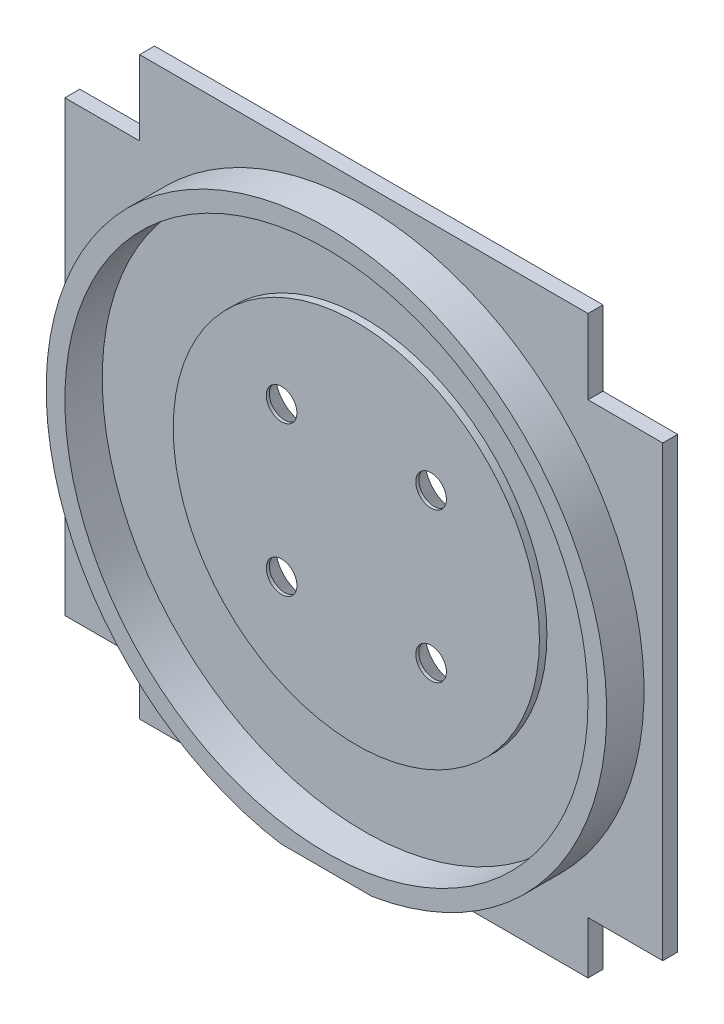
ISO-10303-21;
HEADER;
FILE_DESCRIPTION(('STEP AP214'),'2;1');
FILE_NAME('part.step','',(''),(''),'','','');
FILE_SCHEMA(('AUTOMOTIVE_DESIGN { 1 0 10303 214 1 1 1 1 }'));
ENDSEC;
DATA;
#1=APPLICATION_CONTEXT('core data for automotive mechanical design processes');
#2=APPLICATION_PROTOCOL_DEFINITION('international standard','automotive_design',2000,#1);
#3=PRODUCT_CONTEXT('',#1,'mechanical');
#4=PRODUCT('Part','Part','',(#3));
#5=PRODUCT_RELATED_PRODUCT_CATEGORY('part','',(#4));
#6=PRODUCT_DEFINITION_FORMATION('','',#4);
#7=PRODUCT_DEFINITION_CONTEXT('part definition',#1,'design');
#8=PRODUCT_DEFINITION('design','',#6,#7);
#9=PRODUCT_DEFINITION_SHAPE('','',#8);
#10=(LENGTH_UNIT() NAMED_UNIT(*) SI_UNIT(.MILLI.,.METRE.));
#11=(NAMED_UNIT(*) PLANE_ANGLE_UNIT() SI_UNIT($,.RADIAN.));
#12=(NAMED_UNIT(*) SI_UNIT($,.STERADIAN.) SOLID_ANGLE_UNIT());
#13=UNCERTAINTY_MEASURE_WITH_UNIT(LENGTH_MEASURE(1.E-05),#10,'distance_accuracy_value','');
#14=(GEOMETRIC_REPRESENTATION_CONTEXT(3) GLOBAL_UNCERTAINTY_ASSIGNED_CONTEXT((#13)) GLOBAL_UNIT_ASSIGNED_CONTEXT((#10,
#11,#12)) REPRESENTATION_CONTEXT('',''));
#15=CARTESIAN_POINT('',(0.,0.,0.));
#16=DIRECTION('',(0.,0.,1.));
#17=DIRECTION('',(1.,0.,0.));
#18=AXIS2_PLACEMENT_3D('',#15,#16,#17);
#19=CARTESIAN_POINT('',(0.,0.,2.));
#20=DIRECTION('',(0.,0.,-1.));
#21=DIRECTION('',(-1.,0.,0.));
#22=AXIS2_PLACEMENT_3D('',#19,#20,#21);
#23=PLANE('',#22);
#24=DIRECTION('',(0.,1.,0.));
#25=VECTOR('',#24,1.);
#26=CARTESIAN_POINT('',(70.,0.,2.));
#27=LINE('',#26,#25);
#28=CARTESIAN_POINT('',(70.,3.,2.));
#29=VERTEX_POINT('',#28);
#30=CARTESIAN_POINT('',(70.,10.,2.));
#31=VERTEX_POINT('',#30);
#32=EDGE_CURVE('E48',#29,#31,#27,.T.);
#33=ORIENTED_EDGE('',*,*,#32,.T.);
#34=DIRECTION('',(1.,0.,0.));
#35=VECTOR('',#34,1.);
#36=CARTESIAN_POINT('',(0.,10.,2.));
#37=LINE('',#36,#35);
#38=CARTESIAN_POINT('',(80.,10.,2.));
#39=VERTEX_POINT('',#38);
#40=EDGE_CURVE('E376',#31,#39,#37,.T.);
#41=ORIENTED_EDGE('',*,*,#40,.T.);
#42=DIRECTION('',(0.,1.,0.));
#43=VECTOR('',#42,1.);
#44=CARTESIAN_POINT('',(80.,0.,2.));
#45=LINE('',#44,#43);
#46=CARTESIAN_POINT('',(80.,70.,2.));
#47=VERTEX_POINT('',#46);
#48=EDGE_CURVE('E189',#39,#47,#45,.T.);
#49=ORIENTED_EDGE('',*,*,#48,.T.);
#50=DIRECTION('',(-1.,0.,0.));
#51=VECTOR('',#50,1.);
#52=CARTESIAN_POINT('',(0.,70.,2.));
#53=LINE('',#52,#51);
#54=CARTESIAN_POINT('',(70.,70.,2.));
#55=VERTEX_POINT('',#54);
#56=EDGE_CURVE('E156',#47,#55,#53,.T.);
#57=ORIENTED_EDGE('',*,*,#56,.T.);
#58=DIRECTION('',(0.,1.,0.));
#59=VECTOR('',#58,1.);
#60=CARTESIAN_POINT('',(70.,0.,2.));
#61=LINE('',#60,#59);
#62=CARTESIAN_POINT('',(70.,80.,2.));
#63=VERTEX_POINT('',#62);
#64=EDGE_CURVE('E150',#55,#63,#61,.T.);
#65=ORIENTED_EDGE('',*,*,#64,.T.);
#66=DIRECTION('',(-1.,0.,0.));
#67=VECTOR('',#66,1.);
#68=CARTESIAN_POINT('',(0.,80.,2.));
#69=LINE('',#68,#67);
#70=CARTESIAN_POINT('',(10.,80.,2.));
#71=VERTEX_POINT('',#70);
#72=EDGE_CURVE('E192',#63,#71,#69,.T.);
#73=ORIENTED_EDGE('',*,*,#72,.T.);
#74=DIRECTION('',(0.,-1.,0.));
#75=VECTOR('',#74,1.);
#76=CARTESIAN_POINT('',(9.99999999999999,0.,2.));
#77=LINE('',#76,#75);
#78=CARTESIAN_POINT('',(10.,70.,2.));
#79=VERTEX_POINT('',#78);
#80=EDGE_CURVE('E404',#71,#79,#77,.T.);
#81=ORIENTED_EDGE('',*,*,#80,.T.);
#82=DIRECTION('',(-1.,0.,0.));
#83=VECTOR('',#82,1.);
#84=CARTESIAN_POINT('',(0.,70.,2.));
#85=LINE('',#84,#83);
#86=CARTESIAN_POINT('',(0.,70.,2.));
#87=VERTEX_POINT('',#86);
#88=EDGE_CURVE('E410',#79,#87,#85,.T.);
#89=ORIENTED_EDGE('',*,*,#88,.T.);
#90=DIRECTION('',(0.,-1.,0.));
#91=VECTOR('',#90,1.);
#92=CARTESIAN_POINT('',(0.,0.,2.));
#93=LINE('',#92,#91);
#94=CARTESIAN_POINT('',(0.,10.,2.));
#95=VERTEX_POINT('',#94);
#96=EDGE_CURVE('E186',#87,#95,#93,.T.);
#97=ORIENTED_EDGE('',*,*,#96,.T.);
#98=DIRECTION('',(1.,0.,0.));
#99=VECTOR('',#98,1.);
#100=CARTESIAN_POINT('',(0.,10.,2.));
#101=LINE('',#100,#99);
#102=CARTESIAN_POINT('',(10.,10.,2.));
#103=VERTEX_POINT('',#102);
#104=EDGE_CURVE('E393',#95,#103,#101,.T.);
#105=ORIENTED_EDGE('',*,*,#104,.T.);
#106=DIRECTION('',(0.,-1.,0.));
#107=VECTOR('',#106,1.);
#108=CARTESIAN_POINT('',(10.,0.,2.));
#109=LINE('',#108,#107);
#110=CARTESIAN_POINT('',(10.,3.,2.));
#111=VERTEX_POINT('',#110);
#112=EDGE_CURVE('E244',#103,#111,#109,.T.);
#113=ORIENTED_EDGE('',*,*,#112,.T.);
#114=DIRECTION('',(1.,0.,0.));
#115=VECTOR('',#114,1.);
#116=CARTESIAN_POINT('',(0.,3.,2.));
#117=LINE('',#116,#115);
#118=CARTESIAN_POINT('',(33.8967221921331,3.,2.));
#119=VERTEX_POINT('',#118);
#120=EDGE_CURVE('E153',#111,#119,#117,.T.);
#121=ORIENTED_EDGE('',*,*,#120,.T.);
#122=CARTESIAN_POINT('',(40.,40.,2.));
#123=DIRECTION('',(0.,0.,-1.));
#124=DIRECTION('',(-1.,0.,0.));
#125=AXIS2_PLACEMENT_3D('',#122,#123,#124);
#126=CIRCLE('',#125,37.5);
#127=CARTESIAN_POINT('',(46.1032778078669,3.,2.));
#128=VERTEX_POINT('',#127);
#129=EDGE_CURVE('E228',#128,#119,#126,.F.);
#130=ORIENTED_EDGE('',*,*,#129,.F.);
#131=EDGE_CURVE('E160',#128,#29,#117,.T.);
#132=ORIENTED_EDGE('',*,*,#131,.T.);
#133=EDGE_LOOP('',(#33,#41,#49,#57,#65,#73,#81,#89,#97,#105,#113,#121,#130,#132));
#134=FACE_BOUND('',#133,.T.);
#135=ADVANCED_FACE('F33',(#134),#23,.F.);
#136=CARTESIAN_POINT('',(40.,40.,2.));
#137=DIRECTION('',(0.,0.,1.));
#138=DIRECTION('',(1.,0.,0.));
#139=AXIS2_PLACEMENT_3D('',#136,#137,#138);
#140=CIRCLE('',#139,35.);
#141=CARTESIAN_POINT('',(75.,40.,2.));
#142=VERTEX_POINT('',#141);
#143=EDGE_CURVE('E165',#142,#142,#140,.T.);
#144=ORIENTED_EDGE('',*,*,#143,.T.);
#145=EDGE_LOOP('',(#144));
#146=FACE_BOUND('',#145,.T.);
#147=CARTESIAN_POINT('',(40.,40.,2.));
#148=DIRECTION('',(0.,0.,-1.));
#149=DIRECTION('',(-1.,0.,0.));
#150=AXIS2_PLACEMENT_3D('',#147,#148,#149);
#151=CIRCLE('',#150,24.5);
#152=CARTESIAN_POINT('',(15.5,40.,2.));
#153=VERTEX_POINT('',#152);
#154=EDGE_CURVE('E195',#153,#153,#151,.F.);
#155=ORIENTED_EDGE('',*,*,#154,.F.);
#156=EDGE_LOOP('',(#155));
#157=FACE_BOUND('',#156,.T.);
#158=ADVANCED_FACE('F258',(#146,#157),#23,.F.);
#159=CARTESIAN_POINT('',(0.,0.,2.));
#160=DIRECTION('',(1.,0.,0.));
#161=DIRECTION('',(0.,0.,-1.));
#162=AXIS2_PLACEMENT_3D('',#159,#160,#161);
#163=PLANE('',#162);
#164=DIRECTION('',(0.,-1.,0.));
#165=VECTOR('',#164,1.);
#166=CARTESIAN_POINT('',(0.,0.,0.));
#167=LINE('',#166,#165);
#168=CARTESIAN_POINT('',(0.,70.,0.));
#169=VERTEX_POINT('',#168);
#170=CARTESIAN_POINT('',(0.,10.,0.));
#171=VERTEX_POINT('',#170);
#172=EDGE_CURVE('E185',#169,#171,#167,.T.);
#173=ORIENTED_EDGE('',*,*,#172,.T.);
#174=DIRECTION('',(0.,0.,-1.));
#175=VECTOR('',#174,1.);
#176=CARTESIAN_POINT('',(0.,10.,7.));
#177=LINE('',#176,#175);
#178=EDGE_CURVE('E388',#95,#171,#177,.T.);
#179=ORIENTED_EDGE('',*,*,#178,.F.);
#180=ORIENTED_EDGE('',*,*,#96,.F.);
#181=DIRECTION('',(0.,0.,-1.));
#182=VECTOR('',#181,1.);
#183=CARTESIAN_POINT('',(0.,70.,7.));
#184=LINE('',#183,#182);
#185=EDGE_CURVE('E401',#87,#169,#184,.T.);
#186=ORIENTED_EDGE('',*,*,#185,.T.);
#187=EDGE_LOOP('',(#173,#179,#180,#186));
#188=FACE_BOUND('',#187,.T.);
#189=ADVANCED_FACE('F261',(#188),#163,.F.);
#190=CARTESIAN_POINT('',(80.,0.,2.));
#191=DIRECTION('',(-1.,0.,0.));
#192=DIRECTION('',(0.,0.,1.));
#193=AXIS2_PLACEMENT_3D('',#190,#191,#192);
#194=PLANE('',#193);
#195=ORIENTED_EDGE('',*,*,#48,.F.);
#196=DIRECTION('',(0.,0.,-1.));
#197=VECTOR('',#196,1.);
#198=CARTESIAN_POINT('',(80.,10.,7.));
#199=LINE('',#198,#197);
#200=CARTESIAN_POINT('',(80.,10.,0.));
#201=VERTEX_POINT('',#200);
#202=EDGE_CURVE('E377',#39,#201,#199,.T.);
#203=ORIENTED_EDGE('',*,*,#202,.T.);
#204=DIRECTION('',(0.,1.,0.));
#205=VECTOR('',#204,1.);
#206=CARTESIAN_POINT('',(80.,0.,0.));
#207=LINE('',#206,#205);
#208=CARTESIAN_POINT('',(80.,70.,0.));
#209=VERTEX_POINT('',#208);
#210=EDGE_CURVE('E198',#201,#209,#207,.T.);
#211=ORIENTED_EDGE('',*,*,#210,.T.);
#212=DIRECTION('',(0.,0.,-1.));
#213=VECTOR('',#212,1.);
#214=CARTESIAN_POINT('',(80.,70.,7.));
#215=LINE('',#214,#213);
#216=EDGE_CURVE('E418',#47,#209,#215,.T.);
#217=ORIENTED_EDGE('',*,*,#216,.F.);
#218=EDGE_LOOP('',(#195,#203,#211,#217));
#219=FACE_BOUND('',#218,.T.);
#220=ADVANCED_FACE('F286',(#219),#194,.F.);
#221=CARTESIAN_POINT('',(0.,80.,2.));
#222=DIRECTION('',(0.,-1.,0.));
#223=DIRECTION('',(0.,0.,-1.));
#224=AXIS2_PLACEMENT_3D('',#221,#222,#223);
#225=PLANE('',#224);
#226=DIRECTION('',(-1.,0.,0.));
#227=VECTOR('',#226,1.);
#228=CARTESIAN_POINT('',(0.,80.,0.));
#229=LINE('',#228,#227);
#230=CARTESIAN_POINT('',(70.,80.,0.));
#231=VERTEX_POINT('',#230);
#232=CARTESIAN_POINT('',(10.,80.,0.));
#233=VERTEX_POINT('',#232);
#234=EDGE_CURVE('E190',#231,#233,#229,.T.);
#235=ORIENTED_EDGE('',*,*,#234,.T.);
#236=DIRECTION('',(0.,0.,-1.));
#237=VECTOR('',#236,1.);
#238=CARTESIAN_POINT('',(10.,80.,7.));
#239=LINE('',#238,#237);
#240=EDGE_CURVE('E400',#71,#233,#239,.T.);
#241=ORIENTED_EDGE('',*,*,#240,.F.);
#242=ORIENTED_EDGE('',*,*,#72,.F.);
#243=DIRECTION('',(0.,0.,-1.));
#244=VECTOR('',#243,1.);
#245=CARTESIAN_POINT('',(70.,80.,7.));
#246=LINE('',#245,#244);
#247=EDGE_CURVE('E419',#63,#231,#246,.T.);
#248=ORIENTED_EDGE('',*,*,#247,.T.);
#249=EDGE_LOOP('',(#235,#241,#242,#248));
#250=FACE_BOUND('',#249,.T.);
#251=ADVANCED_FACE('F277',(#250),#225,.F.);
#252=CARTESIAN_POINT('',(0.,0.,0.));
#253=DIRECTION('',(0.,0.,-1.));
#254=DIRECTION('',(-1.,0.,0.));
#255=AXIS2_PLACEMENT_3D('',#252,#253,#254);
#256=PLANE('',#255);
#257=DIRECTION('',(1.,0.,0.));
#258=VECTOR('',#257,1.);
#259=CARTESIAN_POINT('',(80.,10.,0.));
#260=LINE('',#259,#258);
#261=CARTESIAN_POINT('',(70.,10.,0.));
#262=VERTEX_POINT('',#261);
#263=EDGE_CURVE('E145',#262,#201,#260,.T.);
#264=ORIENTED_EDGE('',*,*,#263,.F.);
#265=DIRECTION('',(0.,1.,0.));
#266=VECTOR('',#265,1.);
#267=CARTESIAN_POINT('',(70.,3.,0.));
#268=LINE('',#267,#266);
#269=CARTESIAN_POINT('',(70.,3.,0.));
#270=VERTEX_POINT('',#269);
#271=EDGE_CURVE('E134',#270,#262,#268,.T.);
#272=ORIENTED_EDGE('',*,*,#271,.F.);
#273=DIRECTION('',(1.,0.,0.));
#274=VECTOR('',#273,1.);
#275=CARTESIAN_POINT('',(80.,3.,0.));
#276=LINE('',#275,#274);
#277=CARTESIAN_POINT('',(9.99999999999999,3.,0.));
#278=VERTEX_POINT('',#277);
#279=EDGE_CURVE('E143',#278,#270,#276,.T.);
#280=ORIENTED_EDGE('',*,*,#279,.F.);
#281=DIRECTION('',(0.,-1.,0.));
#282=VECTOR('',#281,1.);
#283=CARTESIAN_POINT('',(10.,3.,0.));
#284=LINE('',#283,#282);
#285=CARTESIAN_POINT('',(10.,10.,0.));
#286=VERTEX_POINT('',#285);
#287=EDGE_CURVE('E55',#286,#278,#284,.T.);
#288=ORIENTED_EDGE('',*,*,#287,.F.);
#289=DIRECTION('',(1.,0.,0.));
#290=VECTOR('',#289,1.);
#291=CARTESIAN_POINT('',(0.,10.,0.));
#292=LINE('',#291,#290);
#293=EDGE_CURVE('E384',#171,#286,#292,.T.);
#294=ORIENTED_EDGE('',*,*,#293,.F.);
#295=ORIENTED_EDGE('',*,*,#172,.F.);
#296=DIRECTION('',(-1.,0.,0.));
#297=VECTOR('',#296,1.);
#298=CARTESIAN_POINT('',(0.,70.,0.));
#299=LINE('',#298,#297);
#300=CARTESIAN_POINT('',(10.,70.,0.));
#301=VERTEX_POINT('',#300);
#302=EDGE_CURVE('E398',#301,#169,#299,.T.);
#303=ORIENTED_EDGE('',*,*,#302,.F.);
#304=DIRECTION('',(0.,-1.,0.));
#305=VECTOR('',#304,1.);
#306=CARTESIAN_POINT('',(10.,80.,0.));
#307=LINE('',#306,#305);
#308=EDGE_CURVE('E395',#233,#301,#307,.T.);
#309=ORIENTED_EDGE('',*,*,#308,.F.);
#310=ORIENTED_EDGE('',*,*,#234,.F.);
#311=DIRECTION('',(0.,1.,0.));
#312=VECTOR('',#311,1.);
#313=CARTESIAN_POINT('',(70.,80.,0.));
#314=LINE('',#313,#312);
#315=CARTESIAN_POINT('',(70.,70.,0.));
#316=VERTEX_POINT('',#315);
#317=EDGE_CURVE('E416',#316,#231,#314,.T.);
#318=ORIENTED_EDGE('',*,*,#317,.F.);
#319=DIRECTION('',(-1.,0.,0.));
#320=VECTOR('',#319,1.);
#321=CARTESIAN_POINT('',(80.,70.,0.));
#322=LINE('',#321,#320);
#323=EDGE_CURVE('E413',#209,#316,#322,.T.);
#324=ORIENTED_EDGE('',*,*,#323,.F.);
#325=ORIENTED_EDGE('',*,*,#210,.F.);
#326=EDGE_LOOP('',(#264,#272,#280,#288,#294,#295,#303,#309,#310,#318,#324,#325));
#327=FACE_BOUND('',#326,.T.);
#328=CARTESIAN_POINT('',(50.,30.,0.));
#329=DIRECTION('',(0.,0.,-1.));
#330=DIRECTION('',(-1.,0.,0.));
#331=AXIS2_PLACEMENT_3D('',#328,#329,#330);
#332=CIRCLE('',#331,3.8);
#333=CARTESIAN_POINT('',(46.2,30.,0.));
#334=VERTEX_POINT('',#333);
#335=EDGE_CURVE('E216',#334,#334,#332,.F.);
#336=ORIENTED_EDGE('',*,*,#335,.T.);
#337=EDGE_LOOP('',(#336));
#338=FACE_BOUND('',#337,.T.);
#339=CARTESIAN_POINT('',(30.,30.,0.));
#340=DIRECTION('',(0.,0.,-1.));
#341=DIRECTION('',(-1.,0.,0.));
#342=AXIS2_PLACEMENT_3D('',#339,#340,#341);
#343=CIRCLE('',#342,3.80000000000001);
#344=CARTESIAN_POINT('',(26.2,30.,0.));
#345=VERTEX_POINT('',#344);
#346=EDGE_CURVE('E213',#345,#345,#343,.F.);
#347=ORIENTED_EDGE('',*,*,#346,.T.);
#348=EDGE_LOOP('',(#347));
#349=FACE_BOUND('',#348,.T.);
#350=CARTESIAN_POINT('',(30.,50.,0.));
#351=DIRECTION('',(0.,0.,-1.));
#352=DIRECTION('',(-1.,0.,0.));
#353=AXIS2_PLACEMENT_3D('',#350,#351,#352);
#354=CIRCLE('',#353,3.80000000000001);
#355=CARTESIAN_POINT('',(26.2,50.,0.));
#356=VERTEX_POINT('',#355);
#357=EDGE_CURVE('E210',#356,#356,#354,.F.);
#358=ORIENTED_EDGE('',*,*,#357,.T.);
#359=EDGE_LOOP('',(#358));
#360=FACE_BOUND('',#359,.T.);
#361=CARTESIAN_POINT('',(50.,50.,0.));
#362=DIRECTION('',(0.,0.,-1.));
#363=DIRECTION('',(-1.,0.,0.));
#364=AXIS2_PLACEMENT_3D('',#361,#362,#363);
#365=CIRCLE('',#364,3.8);
#366=CARTESIAN_POINT('',(46.2,50.,0.));
#367=VERTEX_POINT('',#366);
#368=EDGE_CURVE('E207',#367,#367,#365,.F.);
#369=ORIENTED_EDGE('',*,*,#368,.T.);
#370=EDGE_LOOP('',(#369));
#371=FACE_BOUND('',#370,.T.);
#372=ADVANCED_FACE('F141',(#327,#338,#349,#360,#371),#256,.T.);
#373=CARTESIAN_POINT('',(40.,40.,3.));
#374=DIRECTION('',(0.,0.,-1.));
#375=DIRECTION('',(-1.,0.,0.));
#376=AXIS2_PLACEMENT_3D('',#373,#374,#375);
#377=CYLINDRICAL_SURFACE('',#376,24.5);
#378=CARTESIAN_POINT('',(40.,40.,3.));
#379=DIRECTION('',(0.,0.,1.));
#380=DIRECTION('',(1.,0.,0.));
#381=AXIS2_PLACEMENT_3D('',#378,#379,#380);
#382=CIRCLE('',#381,24.5);
#383=CARTESIAN_POINT('',(64.5,40.,3.));
#384=VERTEX_POINT('',#383);
#385=EDGE_CURVE('E182',#384,#384,#382,.T.);
#386=ORIENTED_EDGE('',*,*,#385,.F.);
#387=EDGE_LOOP('',(#386));
#388=FACE_BOUND('',#387,.T.);
#389=ORIENTED_EDGE('',*,*,#154,.T.);
#390=EDGE_LOOP('',(#389));
#391=FACE_BOUND('',#390,.T.);
#392=ADVANCED_FACE('F265',(#388,#391),#377,.T.);
#393=CARTESIAN_POINT('',(40.,40.,3.));
#394=DIRECTION('',(0.,0.,1.));
#395=DIRECTION('',(1.,0.,0.));
#396=AXIS2_PLACEMENT_3D('',#393,#394,#395);
#397=PLANE('',#396);
#398=CARTESIAN_POINT('',(30.,50.,3.));
#399=DIRECTION('',(0.,0.,-1.));
#400=DIRECTION('',(-1.,0.,0.));
#401=AXIS2_PLACEMENT_3D('',#398,#399,#400);
#402=CIRCLE('',#401,2.05);
#403=CARTESIAN_POINT('',(27.95,50.,3.));
#404=VERTEX_POINT('',#403);
#405=EDGE_CURVE('E170',#404,#404,#402,.T.);
#406=ORIENTED_EDGE('',*,*,#405,.T.);
#407=EDGE_LOOP('',(#406));
#408=FACE_BOUND('',#407,.T.);
#409=CARTESIAN_POINT('',(30.,30.,3.));
#410=DIRECTION('',(0.,0.,-1.));
#411=DIRECTION('',(-1.,0.,0.));
#412=AXIS2_PLACEMENT_3D('',#409,#410,#411);
#413=CIRCLE('',#412,2.05);
#414=CARTESIAN_POINT('',(27.95,30.,3.));
#415=VERTEX_POINT('',#414);
#416=EDGE_CURVE('E173',#415,#415,#413,.T.);
#417=ORIENTED_EDGE('',*,*,#416,.T.);
#418=EDGE_LOOP('',(#417));
#419=FACE_BOUND('',#418,.T.);
#420=CARTESIAN_POINT('',(50.,30.,3.));
#421=DIRECTION('',(0.,0.,-1.));
#422=DIRECTION('',(-1.,0.,0.));
#423=AXIS2_PLACEMENT_3D('',#420,#421,#422);
#424=CIRCLE('',#423,2.04999999999999);
#425=CARTESIAN_POINT('',(47.95,30.,3.));
#426=VERTEX_POINT('',#425);
#427=EDGE_CURVE('E176',#426,#426,#424,.T.);
#428=ORIENTED_EDGE('',*,*,#427,.T.);
#429=EDGE_LOOP('',(#428));
#430=FACE_BOUND('',#429,.T.);
#431=CARTESIAN_POINT('',(50.,50.,3.));
#432=DIRECTION('',(0.,0.,-1.));
#433=DIRECTION('',(-1.,0.,0.));
#434=AXIS2_PLACEMENT_3D('',#431,#432,#433);
#435=CIRCLE('',#434,2.04999999999999);
#436=CARTESIAN_POINT('',(47.95,50.,3.));
#437=VERTEX_POINT('',#436);
#438=EDGE_CURVE('E179',#437,#437,#435,.T.);
#439=ORIENTED_EDGE('',*,*,#438,.T.);
#440=EDGE_LOOP('',(#439));
#441=FACE_BOUND('',#440,.T.);
#442=ORIENTED_EDGE('',*,*,#385,.T.);
#443=EDGE_LOOP('',(#442));
#444=FACE_BOUND('',#443,.T.);
#445=ADVANCED_FACE('F267',(#408,#419,#430,#441,#444),#397,.T.);
#446=CARTESIAN_POINT('',(50.,50.,3.));
#447=DIRECTION('',(0.,0.,-1.));
#448=DIRECTION('',(-1.,0.,0.));
#449=AXIS2_PLACEMENT_3D('',#446,#447,#448);
#450=CYLINDRICAL_SURFACE('',#449,2.04999999999999);
#451=CARTESIAN_POINT('',(50.,50.,2.59448169489728));
#452=DIRECTION('',(0.,0.,-1.));
#453=DIRECTION('',(-1.,0.,0.));
#454=AXIS2_PLACEMENT_3D('',#451,#452,#453);
#455=CIRCLE('',#454,2.04999999999999);
#456=CARTESIAN_POINT('',(47.95,50.,2.59448169489728));
#457=VERTEX_POINT('',#456);
#458=EDGE_CURVE('E225',#457,#457,#455,.T.);
#459=ORIENTED_EDGE('',*,*,#458,.T.);
#460=EDGE_LOOP('',(#459));
#461=FACE_BOUND('',#460,.T.);
#462=ORIENTED_EDGE('',*,*,#438,.F.);
#463=EDGE_LOOP('',(#462));
#464=FACE_BOUND('',#463,.T.);
#465=ADVANCED_FACE('F274',(#461,#464),#450,.F.);
#466=CARTESIAN_POINT('',(50.,30.,3.));
#467=DIRECTION('',(0.,0.,-1.));
#468=DIRECTION('',(-1.,0.,0.));
#469=AXIS2_PLACEMENT_3D('',#466,#467,#468);
#470=CYLINDRICAL_SURFACE('',#469,2.04999999999999);
#471=CARTESIAN_POINT('',(50.,30.,2.59448169489728));
#472=DIRECTION('',(0.,0.,-1.));
#473=DIRECTION('',(-1.,0.,0.));
#474=AXIS2_PLACEMENT_3D('',#471,#472,#473);
#475=CIRCLE('',#474,2.04999999999999);
#476=CARTESIAN_POINT('',(47.95,30.,2.59448169489728));
#477=VERTEX_POINT('',#476);
#478=EDGE_CURVE('E204',#477,#477,#475,.T.);
#479=ORIENTED_EDGE('',*,*,#478,.T.);
#480=EDGE_LOOP('',(#479));
#481=FACE_BOUND('',#480,.T.);
#482=ORIENTED_EDGE('',*,*,#427,.F.);
#483=EDGE_LOOP('',(#482));
#484=FACE_BOUND('',#483,.T.);
#485=ADVANCED_FACE('F327',(#481,#484),#470,.F.);
#486=CARTESIAN_POINT('',(30.,30.,3.));
#487=DIRECTION('',(0.,0.,-1.));
#488=DIRECTION('',(-1.,0.,0.));
#489=AXIS2_PLACEMENT_3D('',#486,#487,#488);
#490=CYLINDRICAL_SURFACE('',#489,2.05);
#491=CARTESIAN_POINT('',(30.,30.,2.59448169489731));
#492=DIRECTION('',(0.,0.,-1.));
#493=DIRECTION('',(-1.,0.,0.));
#494=AXIS2_PLACEMENT_3D('',#491,#492,#493);
#495=CIRCLE('',#494,2.05);
#496=CARTESIAN_POINT('',(27.95,30.,2.59448169489731));
#497=VERTEX_POINT('',#496);
#498=EDGE_CURVE('E219',#497,#497,#495,.T.);
#499=ORIENTED_EDGE('',*,*,#498,.T.);
#500=EDGE_LOOP('',(#499));
#501=FACE_BOUND('',#500,.T.);
#502=ORIENTED_EDGE('',*,*,#416,.F.);
#503=EDGE_LOOP('',(#502));
#504=FACE_BOUND('',#503,.T.);
#505=ADVANCED_FACE('F315',(#501,#504),#490,.F.);
#506=CARTESIAN_POINT('',(30.,50.,3.));
#507=DIRECTION('',(0.,0.,-1.));
#508=DIRECTION('',(-1.,0.,0.));
#509=AXIS2_PLACEMENT_3D('',#506,#507,#508);
#510=CYLINDRICAL_SURFACE('',#509,2.05);
#511=CARTESIAN_POINT('',(30.,50.,2.59448169489731));
#512=DIRECTION('',(0.,0.,-1.));
#513=DIRECTION('',(-1.,0.,0.));
#514=AXIS2_PLACEMENT_3D('',#511,#512,#513);
#515=CIRCLE('',#514,2.05);
#516=CARTESIAN_POINT('',(27.95,50.,2.59448169489731));
#517=VERTEX_POINT('',#516);
#518=EDGE_CURVE('E222',#517,#517,#515,.T.);
#519=ORIENTED_EDGE('',*,*,#518,.T.);
#520=EDGE_LOOP('',(#519));
#521=FACE_BOUND('',#520,.T.);
#522=ORIENTED_EDGE('',*,*,#405,.F.);
#523=EDGE_LOOP('',(#522));
#524=FACE_BOUND('',#523,.T.);
#525=ADVANCED_FACE('F298',(#521,#524),#510,.F.);
#526=CARTESIAN_POINT('',(50.,30.,2.59448169489728));
#527=DIRECTION('',(0.,0.,-1.));
#528=DIRECTION('',(-1.,0.,0.));
#529=AXIS2_PLACEMENT_3D('',#526,#527,#528);
#530=CONICAL_SURFACE('',#529,2.04999999999999,0.593411945678076);
#531=ORIENTED_EDGE('',*,*,#335,.F.);
#532=EDGE_LOOP('',(#531));
#533=FACE_BOUND('',#532,.T.);
#534=ORIENTED_EDGE('',*,*,#478,.F.);
#535=EDGE_LOOP('',(#534));
#536=FACE_BOUND('',#535,.T.);
#537=ADVANCED_FACE('F294',(#533,#536),#530,.F.);
#538=CARTESIAN_POINT('',(30.,30.,2.59448169489731));
#539=DIRECTION('',(0.,0.,-1.));
#540=DIRECTION('',(-1.,0.,0.));
#541=AXIS2_PLACEMENT_3D('',#538,#539,#540);
#542=CONICAL_SURFACE('',#541,2.05,0.593411945678072);
#543=ORIENTED_EDGE('',*,*,#346,.F.);
#544=EDGE_LOOP('',(#543));
#545=FACE_BOUND('',#544,.T.);
#546=ORIENTED_EDGE('',*,*,#498,.F.);
#547=EDGE_LOOP('',(#546));
#548=FACE_BOUND('',#547,.T.);
#549=ADVANCED_FACE('F297',(#545,#548),#542,.F.);
#550=CARTESIAN_POINT('',(30.,50.,2.59448169489731));
#551=DIRECTION('',(0.,0.,-1.));
#552=DIRECTION('',(-1.,0.,0.));
#553=AXIS2_PLACEMENT_3D('',#550,#551,#552);
#554=CONICAL_SURFACE('',#553,2.05,0.593411945678072);
#555=ORIENTED_EDGE('',*,*,#357,.F.);
#556=EDGE_LOOP('',(#555));
#557=FACE_BOUND('',#556,.T.);
#558=ORIENTED_EDGE('',*,*,#518,.F.);
#559=EDGE_LOOP('',(#558));
#560=FACE_BOUND('',#559,.T.);
#561=ADVANCED_FACE('F301',(#557,#560),#554,.F.);
#562=CARTESIAN_POINT('',(50.,50.,2.59448169489728));
#563=DIRECTION('',(0.,0.,-1.));
#564=DIRECTION('',(-1.,0.,0.));
#565=AXIS2_PLACEMENT_3D('',#562,#563,#564);
#566=CONICAL_SURFACE('',#565,2.04999999999999,0.593411945678076);
#567=ORIENTED_EDGE('',*,*,#368,.F.);
#568=EDGE_LOOP('',(#567));
#569=FACE_BOUND('',#568,.T.);
#570=ORIENTED_EDGE('',*,*,#458,.F.);
#571=EDGE_LOOP('',(#570));
#572=FACE_BOUND('',#571,.T.);
#573=ADVANCED_FACE('F35',(#569,#572),#566,.F.);
#574=CARTESIAN_POINT('',(40.,40.,7.));
#575=DIRECTION('',(0.,0.,1.));
#576=DIRECTION('',(1.,0.,0.));
#577=AXIS2_PLACEMENT_3D('',#574,#575,#576);
#578=PLANE('',#577);
#579=DIRECTION('',(1.,0.,0.));
#580=VECTOR('',#579,1.);
#581=CARTESIAN_POINT('',(80.,3.,7.));
#582=LINE('',#581,#580);
#583=CARTESIAN_POINT('',(33.8967221921331,3.,7.));
#584=VERTEX_POINT('',#583);
#585=CARTESIAN_POINT('',(46.1032778078669,3.,7.));
#586=VERTEX_POINT('',#585);
#587=EDGE_CURVE('E149',#584,#586,#582,.T.);
#588=ORIENTED_EDGE('',*,*,#587,.T.);
#589=CARTESIAN_POINT('',(40.,40.,7.));
#590=DIRECTION('',(0.,0.,1.));
#591=DIRECTION('',(1.,0.,0.));
#592=AXIS2_PLACEMENT_3D('',#589,#590,#591);
#593=CIRCLE('',#592,37.5);
#594=EDGE_CURVE('E164',#586,#584,#593,.T.);
#595=ORIENTED_EDGE('',*,*,#594,.T.);
#596=EDGE_LOOP('',(#588,#595));
#597=FACE_BOUND('',#596,.T.);
#598=CARTESIAN_POINT('',(40.,40.,7.));
#599=DIRECTION('',(0.,0.,1.));
#600=DIRECTION('',(1.,0.,0.));
#601=AXIS2_PLACEMENT_3D('',#598,#599,#600);
#602=CIRCLE('',#601,35.);
#603=CARTESIAN_POINT('',(75.,40.,7.));
#604=VERTEX_POINT('',#603);
#605=EDGE_CURVE('E161',#604,#604,#602,.T.);
#606=ORIENTED_EDGE('',*,*,#605,.F.);
#607=EDGE_LOOP('',(#606));
#608=FACE_BOUND('',#607,.T.);
#609=ADVANCED_FACE('F246',(#597,#608),#578,.T.);
#610=CARTESIAN_POINT('',(40.,40.,7.));
#611=DIRECTION('',(0.,0.,-1.));
#612=DIRECTION('',(-1.,0.,0.));
#613=AXIS2_PLACEMENT_3D('',#610,#611,#612);
#614=CYLINDRICAL_SURFACE('',#613,37.5);
#615=ORIENTED_EDGE('',*,*,#594,.F.);
#616=DIRECTION('',(0.,0.,-1.));
#617=VECTOR('',#616,1.);
#618=CARTESIAN_POINT('',(46.1032778078669,3.,7.));
#619=LINE('',#618,#617);
#620=EDGE_CURVE('E234',#586,#128,#619,.T.);
#621=ORIENTED_EDGE('',*,*,#620,.T.);
#622=ORIENTED_EDGE('',*,*,#129,.T.);
#623=DIRECTION('',(0.,0.,-1.));
#624=VECTOR('',#623,1.);
#625=CARTESIAN_POINT('',(33.8967221921331,3.,7.));
#626=LINE('',#625,#624);
#627=EDGE_CURVE('E231',#119,#584,#626,.F.);
#628=ORIENTED_EDGE('',*,*,#627,.T.);
#629=EDGE_LOOP('',(#615,#621,#622,#628));
#630=FACE_BOUND('',#629,.T.);
#631=ADVANCED_FACE('F239',(#630),#614,.T.);
#632=CARTESIAN_POINT('',(40.,40.,7.));
#633=DIRECTION('',(0.,0.,-1.));
#634=DIRECTION('',(-1.,0.,0.));
#635=AXIS2_PLACEMENT_3D('',#632,#633,#634);
#636=CYLINDRICAL_SURFACE('',#635,35.);
#637=ORIENTED_EDGE('',*,*,#605,.T.);
#638=EDGE_LOOP('',(#637));
#639=FACE_BOUND('',#638,.T.);
#640=ORIENTED_EDGE('',*,*,#143,.F.);
#641=EDGE_LOOP('',(#640));
#642=FACE_BOUND('',#641,.T.);
#643=ADVANCED_FACE('F252',(#639,#642),#636,.F.);
#644=CARTESIAN_POINT('',(80.,3.,7.));
#645=DIRECTION('',(0.,1.,0.));
#646=DIRECTION('',(-1.,0.,0.));
#647=AXIS2_PLACEMENT_3D('',#644,#645,#646);
#648=PLANE('',#647);
#649=ORIENTED_EDGE('',*,*,#279,.T.);
#650=DIRECTION('',(0.,0.,1.));
#651=VECTOR('',#650,1.);
#652=CARTESIAN_POINT('',(70.,3.,7.));
#653=LINE('',#652,#651);
#654=EDGE_CURVE('E11',#270,#29,#653,.T.);
#655=ORIENTED_EDGE('',*,*,#654,.T.);
#656=ORIENTED_EDGE('',*,*,#131,.F.);
#657=ORIENTED_EDGE('',*,*,#620,.F.);
#658=ORIENTED_EDGE('',*,*,#587,.F.);
#659=ORIENTED_EDGE('',*,*,#627,.F.);
#660=ORIENTED_EDGE('',*,*,#120,.F.);
#661=DIRECTION('',(0.,0.,-1.));
#662=VECTOR('',#661,1.);
#663=CARTESIAN_POINT('',(9.99999999999999,3.,7.));
#664=LINE('',#663,#662);
#665=EDGE_CURVE('E41',#111,#278,#664,.T.);
#666=ORIENTED_EDGE('',*,*,#665,.T.);
#667=EDGE_LOOP('',(#649,#655,#656,#657,#658,#659,#660,#666));
#668=FACE_BOUND('',#667,.T.);
#669=ADVANCED_FACE('F147',(#668),#648,.F.);
#670=CARTESIAN_POINT('',(70.,80.,7.));
#671=DIRECTION('',(-1.,0.,0.));
#672=DIRECTION('',(0.,0.,1.));
#673=AXIS2_PLACEMENT_3D('',#670,#671,#672);
#674=PLANE('',#673);
#675=DIRECTION('',(0.,0.,-1.));
#676=VECTOR('',#675,1.);
#677=CARTESIAN_POINT('',(70.,70.,7.));
#678=LINE('',#677,#676);
#679=EDGE_CURVE('E422',#55,#316,#678,.T.);
#680=ORIENTED_EDGE('',*,*,#679,.T.);
#681=ORIENTED_EDGE('',*,*,#317,.T.);
#682=ORIENTED_EDGE('',*,*,#247,.F.);
#683=ORIENTED_EDGE('',*,*,#64,.F.);
#684=EDGE_LOOP('',(#680,#681,#682,#683));
#685=FACE_BOUND('',#684,.T.);
#686=ADVANCED_FACE('F343',(#685),#674,.F.);
#687=CARTESIAN_POINT('',(80.,70.,7.));
#688=DIRECTION('',(0.,-1.,0.));
#689=DIRECTION('',(0.,0.,-1.));
#690=AXIS2_PLACEMENT_3D('',#687,#688,#689);
#691=PLANE('',#690);
#692=ORIENTED_EDGE('',*,*,#216,.T.);
#693=ORIENTED_EDGE('',*,*,#323,.T.);
#694=ORIENTED_EDGE('',*,*,#679,.F.);
#695=ORIENTED_EDGE('',*,*,#56,.F.);
#696=EDGE_LOOP('',(#692,#693,#694,#695));
#697=FACE_BOUND('',#696,.T.);
#698=ADVANCED_FACE('F344',(#697),#691,.F.);
#699=CARTESIAN_POINT('',(0.,70.,7.));
#700=DIRECTION('',(0.,-1.,0.));
#701=DIRECTION('',(0.,0.,-1.));
#702=AXIS2_PLACEMENT_3D('',#699,#700,#701);
#703=PLANE('',#702);
#704=DIRECTION('',(0.,0.,-1.));
#705=VECTOR('',#704,1.);
#706=CARTESIAN_POINT('',(10.,70.,7.));
#707=LINE('',#706,#705);
#708=EDGE_CURVE('E405',#79,#301,#707,.T.);
#709=ORIENTED_EDGE('',*,*,#708,.T.);
#710=ORIENTED_EDGE('',*,*,#302,.T.);
#711=ORIENTED_EDGE('',*,*,#185,.F.);
#712=ORIENTED_EDGE('',*,*,#88,.F.);
#713=EDGE_LOOP('',(#709,#710,#711,#712));
#714=FACE_BOUND('',#713,.T.);
#715=ADVANCED_FACE('F347',(#714),#703,.F.);
#716=CARTESIAN_POINT('',(10.,80.,7.));
#717=DIRECTION('',(1.,0.,0.));
#718=DIRECTION('',(0.,1.,0.));
#719=AXIS2_PLACEMENT_3D('',#716,#717,#718);
#720=PLANE('',#719);
#721=ORIENTED_EDGE('',*,*,#240,.T.);
#722=ORIENTED_EDGE('',*,*,#308,.T.);
#723=ORIENTED_EDGE('',*,*,#708,.F.);
#724=ORIENTED_EDGE('',*,*,#80,.F.);
#725=EDGE_LOOP('',(#721,#722,#723,#724));
#726=FACE_BOUND('',#725,.T.);
#727=ADVANCED_FACE('F352',(#726),#720,.F.);
#728=CARTESIAN_POINT('',(0.,10.,7.));
#729=DIRECTION('',(0.,1.,0.));
#730=DIRECTION('',(-1.,0.,0.));
#731=AXIS2_PLACEMENT_3D('',#728,#729,#730);
#732=PLANE('',#731);
#733=ORIENTED_EDGE('',*,*,#178,.T.);
#734=ORIENTED_EDGE('',*,*,#293,.T.);
#735=DIRECTION('',(0.,0.,-1.));
#736=VECTOR('',#735,1.);
#737=CARTESIAN_POINT('',(10.,10.,7.));
#738=LINE('',#737,#736);
#739=EDGE_CURVE('E389',#103,#286,#738,.T.);
#740=ORIENTED_EDGE('',*,*,#739,.F.);
#741=ORIENTED_EDGE('',*,*,#104,.F.);
#742=EDGE_LOOP('',(#733,#734,#740,#741));
#743=FACE_BOUND('',#742,.T.);
#744=ADVANCED_FACE('F355',(#743),#732,.F.);
#745=CARTESIAN_POINT('',(10.,3.,7.));
#746=DIRECTION('',(1.,0.,0.));
#747=DIRECTION('',(0.,0.,-1.));
#748=AXIS2_PLACEMENT_3D('',#745,#746,#747);
#749=PLANE('',#748);
#750=ORIENTED_EDGE('',*,*,#739,.T.);
#751=ORIENTED_EDGE('',*,*,#287,.T.);
#752=ORIENTED_EDGE('',*,*,#665,.F.);
#753=ORIENTED_EDGE('',*,*,#112,.F.);
#754=EDGE_LOOP('',(#750,#751,#752,#753));
#755=FACE_BOUND('',#754,.T.);
#756=ADVANCED_FACE('F362',(#755),#749,.F.);
#757=CARTESIAN_POINT('',(80.,10.,7.));
#758=DIRECTION('',(0.,1.,0.));
#759=DIRECTION('',(0.,0.,1.));
#760=AXIS2_PLACEMENT_3D('',#757,#758,#759);
#761=PLANE('',#760);
#762=DIRECTION('',(0.,0.,-1.));
#763=VECTOR('',#762,1.);
#764=CARTESIAN_POINT('',(70.,10.,7.));
#765=LINE('',#764,#763);
#766=EDGE_CURVE('E373',#31,#262,#765,.T.);
#767=ORIENTED_EDGE('',*,*,#766,.T.);
#768=ORIENTED_EDGE('',*,*,#263,.T.);
#769=ORIENTED_EDGE('',*,*,#202,.F.);
#770=ORIENTED_EDGE('',*,*,#40,.F.);
#771=EDGE_LOOP('',(#767,#768,#769,#770));
#772=FACE_BOUND('',#771,.T.);
#773=ADVANCED_FACE('F366',(#772),#761,.F.);
#774=CARTESIAN_POINT('',(70.,3.,7.));
#775=DIRECTION('',(-1.,0.,0.));
#776=DIRECTION('',(0.,0.,1.));
#777=AXIS2_PLACEMENT_3D('',#774,#775,#776);
#778=PLANE('',#777);
#779=ORIENTED_EDGE('',*,*,#654,.F.);
#780=ORIENTED_EDGE('',*,*,#271,.T.);
#781=ORIENTED_EDGE('',*,*,#766,.F.);
#782=ORIENTED_EDGE('',*,*,#32,.F.);
#783=EDGE_LOOP('',(#779,#780,#781,#782));
#784=FACE_BOUND('',#783,.T.);
#785=ADVANCED_FACE('F133',(#784),#778,.F.);
#786=CLOSED_SHELL('',(#135,#158,#189,#220,#251,#372,#392,#445,#465,#485,#505,#525,#537,#549,
#561,#573,#609,#631,#643,#669,#686,#698,#715,#727,#744,#756,#773,#785));
#787=MANIFOLD_SOLID_BREP('B2',#786);
#788=ADVANCED_BREP_SHAPE_REPRESENTATION('',(#18,#787),#14);
#789=SHAPE_DEFINITION_REPRESENTATION(#9,#788);
ENDSEC;
END-ISO-10303-21;
